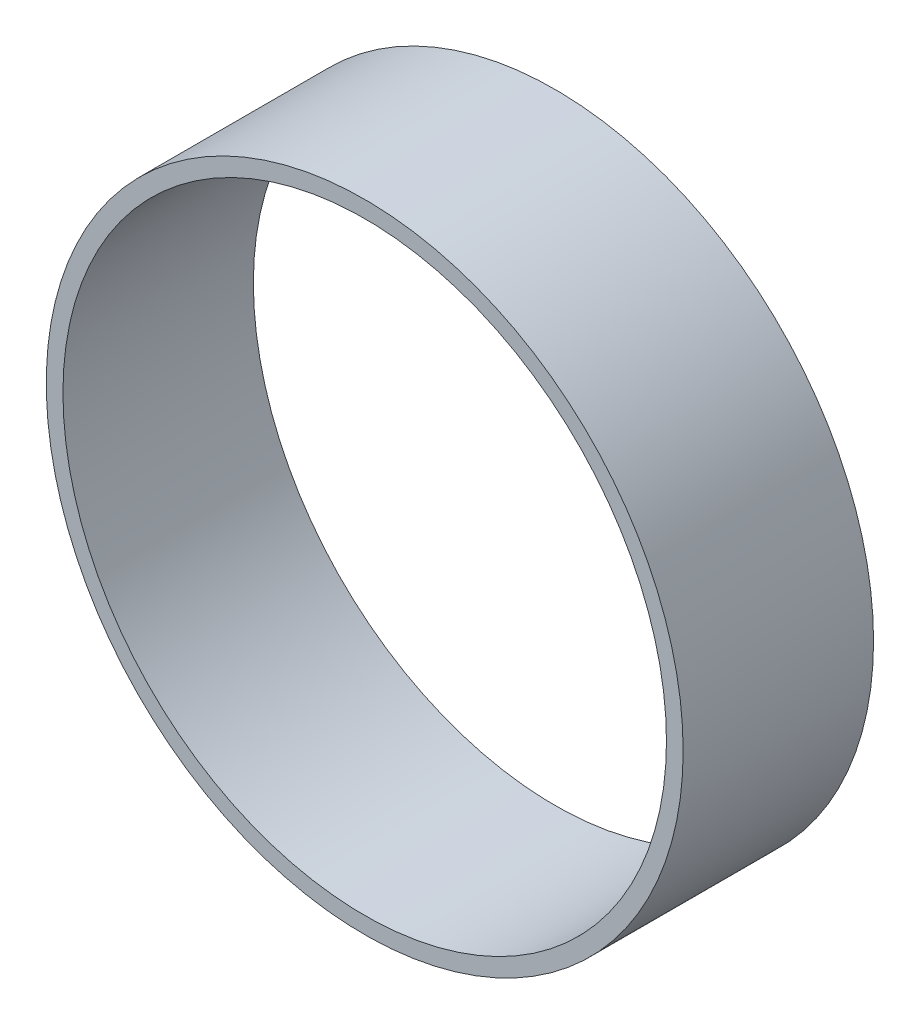
ISO-10303-21;
HEADER;
FILE_DESCRIPTION(('STEP AP214'),'2;1');
FILE_NAME('part.step','',(''),(''),'','','');
FILE_SCHEMA(('AUTOMOTIVE_DESIGN { 1 0 10303 214 1 1 1 1 }'));
ENDSEC;
DATA;
#1=APPLICATION_CONTEXT('core data for automotive mechanical design processes');
#2=APPLICATION_PROTOCOL_DEFINITION('international standard','automotive_design',2000,#1);
#3=PRODUCT_CONTEXT('',#1,'mechanical');
#4=PRODUCT('Part','Part','',(#3));
#5=PRODUCT_RELATED_PRODUCT_CATEGORY('part','',(#4));
#6=PRODUCT_DEFINITION_FORMATION('','',#4);
#7=PRODUCT_DEFINITION_CONTEXT('part definition',#1,'design');
#8=PRODUCT_DEFINITION('design','',#6,#7);
#9=PRODUCT_DEFINITION_SHAPE('','',#8);
#10=(LENGTH_UNIT() NAMED_UNIT(*) SI_UNIT(.MILLI.,.METRE.));
#11=(NAMED_UNIT(*) PLANE_ANGLE_UNIT() SI_UNIT($,.RADIAN.));
#12=(NAMED_UNIT(*) SI_UNIT($,.STERADIAN.) SOLID_ANGLE_UNIT());
#13=UNCERTAINTY_MEASURE_WITH_UNIT(LENGTH_MEASURE(1.E-05),#10,'distance_accuracy_value','');
#14=(GEOMETRIC_REPRESENTATION_CONTEXT(3) GLOBAL_UNCERTAINTY_ASSIGNED_CONTEXT((#13)) GLOBAL_UNIT_ASSIGNED_CONTEXT((#10,
#11,#12)) REPRESENTATION_CONTEXT('',''));
#15=CARTESIAN_POINT('',(0.,0.,0.));
#16=DIRECTION('',(0.,0.,1.));
#17=DIRECTION('',(1.,0.,0.));
#18=AXIS2_PLACEMENT_3D('',#15,#16,#17);
#19=CARTESIAN_POINT('',(0.,0.,0.));
#20=DIRECTION('',(0.,0.,1.));
#21=DIRECTION('',(1.,0.,0.));
#22=AXIS2_PLACEMENT_3D('',#19,#20,#21);
#23=CYLINDRICAL_SURFACE('',#22,45.96);
#24=CARTESIAN_POINT('',(0.,0.,0.));
#25=DIRECTION('',(0.,0.,1.));
#26=DIRECTION('',(1.,0.,0.));
#27=AXIS2_PLACEMENT_3D('',#24,#25,#26);
#28=CIRCLE('',#27,45.96);
#29=CARTESIAN_POINT('',(45.96,0.,0.));
#30=VERTEX_POINT('',#29);
#31=EDGE_CURVE('E52',#30,#30,#28,.T.);
#32=ORIENTED_EDGE('',*,*,#31,.T.);
#33=EDGE_LOOP('',(#32));
#34=FACE_BOUND('',#33,.T.);
#35=CARTESIAN_POINT('',(0.,0.,-29.));
#36=DIRECTION('',(0.,0.,1.));
#37=DIRECTION('',(1.,0.,0.));
#38=AXIS2_PLACEMENT_3D('',#35,#36,#37);
#39=CIRCLE('',#38,45.96);
#40=CARTESIAN_POINT('',(45.96,0.,-29.));
#41=VERTEX_POINT('',#40);
#42=EDGE_CURVE('E10',#41,#41,#39,.T.);
#43=ORIENTED_EDGE('',*,*,#42,.F.);
#44=EDGE_LOOP('',(#43));
#45=FACE_BOUND('',#44,.T.);
#46=ADVANCED_FACE('F38',(#34,#45),#23,.F.);
#47=CARTESIAN_POINT('',(0.,0.,-29.));
#48=DIRECTION('',(0.,0.,-1.));
#49=DIRECTION('',(-1.,0.,0.));
#50=AXIS2_PLACEMENT_3D('',#47,#48,#49);
#51=PLANE('',#50);
#52=ORIENTED_EDGE('',*,*,#42,.T.);
#53=EDGE_LOOP('',(#52));
#54=FACE_BOUND('',#53,.T.);
#55=CARTESIAN_POINT('',(0.,0.,-29.));
#56=DIRECTION('',(0.,0.,1.));
#57=DIRECTION('',(1.,0.,0.));
#58=AXIS2_PLACEMENT_3D('',#55,#56,#57);
#59=CIRCLE('',#58,48.5);
#60=CARTESIAN_POINT('',(48.5,0.,-29.));
#61=VERTEX_POINT('',#60);
#62=EDGE_CURVE('E44',#61,#61,#59,.T.);
#63=ORIENTED_EDGE('',*,*,#62,.F.);
#64=EDGE_LOOP('',(#63));
#65=FACE_BOUND('',#64,.T.);
#66=ADVANCED_FACE('F68',(#54,#65),#51,.T.);
#67=CARTESIAN_POINT('',(0.,0.,0.));
#68=DIRECTION('',(0.,0.,1.));
#69=DIRECTION('',(1.,0.,0.));
#70=AXIS2_PLACEMENT_3D('',#67,#68,#69);
#71=CYLINDRICAL_SURFACE('',#70,48.5);
#72=ORIENTED_EDGE('',*,*,#62,.T.);
#73=EDGE_LOOP('',(#72));
#74=FACE_BOUND('',#73,.T.);
#75=CARTESIAN_POINT('',(0.,0.,0.));
#76=DIRECTION('',(0.,0.,1.));
#77=DIRECTION('',(1.,0.,0.));
#78=AXIS2_PLACEMENT_3D('',#75,#76,#77);
#79=CIRCLE('',#78,48.5);
#80=CARTESIAN_POINT('',(48.5,0.,0.));
#81=VERTEX_POINT('',#80);
#82=EDGE_CURVE('E48',#81,#81,#79,.T.);
#83=ORIENTED_EDGE('',*,*,#82,.F.);
#84=EDGE_LOOP('',(#83));
#85=FACE_BOUND('',#84,.T.);
#86=ADVANCED_FACE('F62',(#74,#85),#71,.T.);
#87=CARTESIAN_POINT('',(0.,0.,0.));
#88=DIRECTION('',(0.,0.,1.));
#89=DIRECTION('',(1.,0.,0.));
#90=AXIS2_PLACEMENT_3D('',#87,#88,#89);
#91=PLANE('',#90);
#92=ORIENTED_EDGE('',*,*,#82,.T.);
#93=EDGE_LOOP('',(#92));
#94=FACE_BOUND('',#93,.T.);
#95=ORIENTED_EDGE('',*,*,#31,.F.);
#96=EDGE_LOOP('',(#95));
#97=FACE_BOUND('',#96,.T.);
#98=ADVANCED_FACE('F60',(#94,#97),#91,.T.);
#99=CLOSED_SHELL('',(#46,#66,#86,#98));
#100=MANIFOLD_SOLID_BREP('B2',#99);
#101=ADVANCED_BREP_SHAPE_REPRESENTATION('',(#18,#100),#14);
#102=SHAPE_DEFINITION_REPRESENTATION(#9,#101);
ENDSEC;
END-ISO-10303-21;
